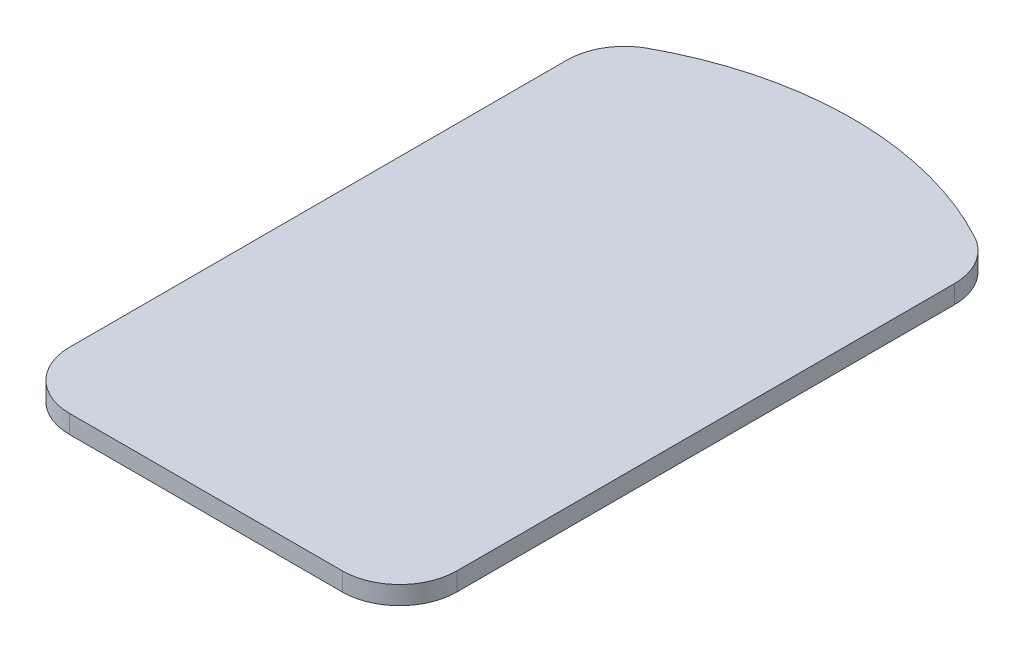
ISO-10303-21;
HEADER;
FILE_DESCRIPTION(('STEP AP214'),'2;1');
FILE_NAME('part.step','',(''),(''),'','','');
FILE_SCHEMA(('AUTOMOTIVE_DESIGN { 1 0 10303 214 1 1 1 1 }'));
ENDSEC;
DATA;
#1=APPLICATION_CONTEXT('core data for automotive mechanical design processes');
#2=APPLICATION_PROTOCOL_DEFINITION('international standard','automotive_design',2000,#1);
#3=PRODUCT_CONTEXT('',#1,'mechanical');
#4=PRODUCT('Part','Part','',(#3));
#5=PRODUCT_RELATED_PRODUCT_CATEGORY('part','',(#4));
#6=PRODUCT_DEFINITION_FORMATION('','',#4);
#7=PRODUCT_DEFINITION_CONTEXT('part definition',#1,'design');
#8=PRODUCT_DEFINITION('design','',#6,#7);
#9=PRODUCT_DEFINITION_SHAPE('','',#8);
#10=(LENGTH_UNIT() NAMED_UNIT(*) SI_UNIT(.MILLI.,.METRE.));
#11=(NAMED_UNIT(*) PLANE_ANGLE_UNIT() SI_UNIT($,.RADIAN.));
#12=(NAMED_UNIT(*) SI_UNIT($,.STERADIAN.) SOLID_ANGLE_UNIT());
#13=UNCERTAINTY_MEASURE_WITH_UNIT(LENGTH_MEASURE(1.E-05),#10,'distance_accuracy_value','');
#14=(GEOMETRIC_REPRESENTATION_CONTEXT(3) GLOBAL_UNCERTAINTY_ASSIGNED_CONTEXT((#13)) GLOBAL_UNIT_ASSIGNED_CONTEXT((#10,
#11,#12)) REPRESENTATION_CONTEXT('',''));
#15=CARTESIAN_POINT('',(0.,0.,0.));
#16=DIRECTION('',(0.,0.,1.));
#17=DIRECTION('',(1.,0.,0.));
#18=AXIS2_PLACEMENT_3D('',#15,#16,#17);
#19=CARTESIAN_POINT('',(-100.196877436676,1.6,22.5043252193321));
#20=DIRECTION('',(0.,-1.,0.));
#21=DIRECTION('',(0.,0.,-1.));
#22=AXIS2_PLACEMENT_3D('',#19,#20,#21);
#23=CYLINDRICAL_SURFACE('',#22,29.8500000000065);
#24=CARTESIAN_POINT('',(-100.196877436676,0.,22.5043252193321));
#25=DIRECTION('',(0.,1.,0.));
#26=DIRECTION('',(0.,0.,-1.));
#27=AXIS2_PLACEMENT_3D('',#24,#25,#26);
#28=CIRCLE('',#27,29.8500000000065);
#29=CARTESIAN_POINT('',(-85.91332210469,0.,-3.70640821333774));
#30=VERTEX_POINT('',#29);
#31=CARTESIAN_POINT('',(-114.480432768673,0.,-3.70640821333214));
#32=VERTEX_POINT('',#31);
#33=EDGE_CURVE('E127',#30,#32,#28,.T.);
#34=ORIENTED_EDGE('',*,*,#33,.T.);
#35=DIRECTION('',(0.,-1.,0.));
#36=VECTOR('',#35,1.);
#37=CARTESIAN_POINT('',(-114.480432768673,1.6,-3.70640821333214));
#38=LINE('',#37,#36);
#39=CARTESIAN_POINT('',(-114.480432768673,1.6,-3.70640821333214));
#40=VERTEX_POINT('',#39);
#41=EDGE_CURVE('E104',#32,#40,#38,.F.);
#42=ORIENTED_EDGE('',*,*,#41,.T.);
#43=CARTESIAN_POINT('',(-100.196877436676,1.6,22.5043252193321));
#44=DIRECTION('',(0.,1.,0.));
#45=DIRECTION('',(0.,0.,-1.));
#46=AXIS2_PLACEMENT_3D('',#43,#44,#45);
#47=CIRCLE('',#46,29.8500000000065);
#48=CARTESIAN_POINT('',(-85.91332210469,1.6,-3.70640821333774));
#49=VERTEX_POINT('',#48);
#50=EDGE_CURVE('E136',#49,#40,#47,.T.);
#51=ORIENTED_EDGE('',*,*,#50,.F.);
#52=DIRECTION('',(0.,-1.,0.));
#53=VECTOR('',#52,1.);
#54=CARTESIAN_POINT('',(-85.91332210469,1.6,-3.70640821333774));
#55=LINE('',#54,#53);
#56=EDGE_CURVE('E109',#49,#30,#55,.T.);
#57=ORIENTED_EDGE('',*,*,#56,.T.);
#58=EDGE_LOOP('',(#34,#42,#51,#57));
#59=FACE_BOUND('',#58,.T.);
#60=ADVANCED_FACE('F32',(#59),#23,.T.);
#61=CARTESIAN_POINT('',(-117.08787743668,1.6,49.0671381404292));
#62=DIRECTION('',(1.,0.,0.));
#63=DIRECTION('',(0.,0.,-1.));
#64=AXIS2_PLACEMENT_3D('',#61,#62,#63);
#65=PLANE('',#64);
#66=DIRECTION('',(0.,0.,1.));
#67=VECTOR('',#66,1.);
#68=CARTESIAN_POINT('',(-117.08787743668,1.6,49.0671381404292));
#69=LINE('',#68,#67);
#70=CARTESIAN_POINT('',(-117.08787743668,1.6,0.683999396828415));
#71=VERTEX_POINT('',#70);
#72=CARTESIAN_POINT('',(-117.08787743668,1.6,44.0671381404292));
#73=VERTEX_POINT('',#72);
#74=EDGE_CURVE('E119',#71,#73,#69,.T.);
#75=ORIENTED_EDGE('',*,*,#74,.F.);
#76=DIRECTION('',(0.,-1.,0.));
#77=VECTOR('',#76,1.);
#78=CARTESIAN_POINT('',(-117.08787743668,1.6,0.683999396828415));
#79=LINE('',#78,#77);
#80=CARTESIAN_POINT('',(-117.08787743668,0.,0.683999396828415));
#81=VERTEX_POINT('',#80);
#82=EDGE_CURVE('E103',#71,#81,#79,.T.);
#83=ORIENTED_EDGE('',*,*,#82,.T.);
#84=DIRECTION('',(0.,0.,1.));
#85=VECTOR('',#84,1.);
#86=CARTESIAN_POINT('',(-117.08787743668,0.,49.0671381404292));
#87=LINE('',#86,#85);
#88=CARTESIAN_POINT('',(-117.08787743668,0.,44.0671381404292));
#89=VERTEX_POINT('',#88);
#90=EDGE_CURVE('E116',#81,#89,#87,.T.);
#91=ORIENTED_EDGE('',*,*,#90,.T.);
#92=DIRECTION('',(0.,-1.,0.));
#93=VECTOR('',#92,1.);
#94=CARTESIAN_POINT('',(-117.08787743668,1.6,44.0671381404292));
#95=LINE('',#94,#93);
#96=EDGE_CURVE('E121',#89,#73,#95,.F.);
#97=ORIENTED_EDGE('',*,*,#96,.T.);
#98=EDGE_LOOP('',(#75,#83,#91,#97));
#99=FACE_BOUND('',#98,.T.);
#100=ADVANCED_FACE('F115',(#99),#65,.F.);
#101=CARTESIAN_POINT('',(-117.08787743668,1.6,49.0671381404292));
#102=DIRECTION('',(0.,0.,-1.));
#103=DIRECTION('',(-1.,0.,0.));
#104=AXIS2_PLACEMENT_3D('',#101,#102,#103);
#105=PLANE('',#104);
#106=DIRECTION('',(1.,0.,0.));
#107=VECTOR('',#106,1.);
#108=CARTESIAN_POINT('',(-117.08787743668,1.6,49.0671381404292));
#109=LINE('',#108,#107);
#110=CARTESIAN_POINT('',(-112.08787743668,1.6,49.0671381404292));
#111=VERTEX_POINT('',#110);
#112=CARTESIAN_POINT('',(-88.3058774366805,1.6,49.0671381404292));
#113=VERTEX_POINT('',#112);
#114=EDGE_CURVE('E159',#111,#113,#109,.T.);
#115=ORIENTED_EDGE('',*,*,#114,.F.);
#116=DIRECTION('',(0.,-1.,0.));
#117=VECTOR('',#116,1.);
#118=CARTESIAN_POINT('',(-112.08787743668,1.6,49.0671381404292));
#119=LINE('',#118,#117);
#120=CARTESIAN_POINT('',(-112.08787743668,0.,49.0671381404292));
#121=VERTEX_POINT('',#120);
#122=EDGE_CURVE('E11',#111,#121,#119,.T.);
#123=ORIENTED_EDGE('',*,*,#122,.T.);
#124=DIRECTION('',(1.,0.,0.));
#125=VECTOR('',#124,1.);
#126=CARTESIAN_POINT('',(-117.08787743668,0.,49.0671381404292));
#127=LINE('',#126,#125);
#128=CARTESIAN_POINT('',(-88.3058774366805,0.,49.0671381404292));
#129=VERTEX_POINT('',#128);
#130=EDGE_CURVE('E126',#121,#129,#127,.T.);
#131=ORIENTED_EDGE('',*,*,#130,.T.);
#132=DIRECTION('',(0.,-1.,0.));
#133=VECTOR('',#132,1.);
#134=CARTESIAN_POINT('',(-88.3058774366805,1.6,49.0671381404292));
#135=LINE('',#134,#133);
#136=EDGE_CURVE('E40',#129,#113,#135,.F.);
#137=ORIENTED_EDGE('',*,*,#136,.T.);
#138=EDGE_LOOP('',(#115,#123,#131,#137));
#139=FACE_BOUND('',#138,.T.);
#140=ADVANCED_FACE('F158',(#139),#105,.F.);
#141=CARTESIAN_POINT('',(-83.3058774366805,1.6,49.0671381404292));
#142=DIRECTION('',(-1.,0.,0.));
#143=DIRECTION('',(0.,0.,1.));
#144=AXIS2_PLACEMENT_3D('',#141,#142,#143);
#145=PLANE('',#144);
#146=DIRECTION('',(0.,0.,-1.));
#147=VECTOR('',#146,1.);
#148=CARTESIAN_POINT('',(-83.3058774366805,0.,49.0671381404292));
#149=LINE('',#148,#147);
#150=CARTESIAN_POINT('',(-83.3058774366805,0.,44.0671381404292));
#151=VERTEX_POINT('',#150);
#152=CARTESIAN_POINT('',(-83.3058774366805,0.,0.683999396823773));
#153=VERTEX_POINT('',#152);
#154=EDGE_CURVE('E130',#151,#153,#149,.T.);
#155=ORIENTED_EDGE('',*,*,#154,.T.);
#156=DIRECTION('',(0.,-1.,0.));
#157=VECTOR('',#156,1.);
#158=CARTESIAN_POINT('',(-83.3058774366805,1.6,0.683999396823759));
#159=LINE('',#158,#157);
#160=CARTESIAN_POINT('',(-83.3058774366805,1.6,0.683999396823773));
#161=VERTEX_POINT('',#160);
#162=EDGE_CURVE('E47',#153,#161,#159,.F.);
#163=ORIENTED_EDGE('',*,*,#162,.T.);
#164=DIRECTION('',(0.,0.,-1.));
#165=VECTOR('',#164,1.);
#166=CARTESIAN_POINT('',(-83.3058774366805,1.6,49.0671381404292));
#167=LINE('',#166,#165);
#168=CARTESIAN_POINT('',(-83.3058774366805,1.6,44.0671381404292));
#169=VERTEX_POINT('',#168);
#170=EDGE_CURVE('E137',#169,#161,#167,.T.);
#171=ORIENTED_EDGE('',*,*,#170,.F.);
#172=DIRECTION('',(0.,-1.,0.));
#173=VECTOR('',#172,1.);
#174=CARTESIAN_POINT('',(-83.3058774366805,1.6,44.0671381404292));
#175=LINE('',#174,#173);
#176=EDGE_CURVE('E152',#169,#151,#175,.T.);
#177=ORIENTED_EDGE('',*,*,#176,.T.);
#178=EDGE_LOOP('',(#155,#163,#171,#177));
#179=FACE_BOUND('',#178,.T.);
#180=ADVANCED_FACE('F168',(#179),#145,.F.);
#181=CARTESIAN_POINT('',(-100.196877436676,1.6,22.5043252193321));
#182=DIRECTION('',(0.,-1.,0.));
#183=DIRECTION('',(0.,0.,-1.));
#184=AXIS2_PLACEMENT_3D('',#181,#182,#183);
#185=PLANE('',#184);
#186=ORIENTED_EDGE('',*,*,#50,.T.);
#187=CARTESIAN_POINT('',(-112.08787743668,1.6,0.683999396828418));
#188=DIRECTION('',(0.,-1.,0.));
#189=DIRECTION('',(0.,0.,-1.));
#190=AXIS2_PLACEMENT_3D('',#187,#188,#189);
#191=CIRCLE('',#190,5.);
#192=EDGE_CURVE('E150',#40,#71,#191,.F.);
#193=ORIENTED_EDGE('',*,*,#192,.T.);
#194=ORIENTED_EDGE('',*,*,#74,.T.);
#195=CARTESIAN_POINT('',(-112.08787743668,1.6,44.0671381404292));
#196=DIRECTION('',(0.,-1.,0.));
#197=DIRECTION('',(0.,0.,-1.));
#198=AXIS2_PLACEMENT_3D('',#195,#196,#197);
#199=CIRCLE('',#198,5.);
#200=EDGE_CURVE('E146',#73,#111,#199,.F.);
#201=ORIENTED_EDGE('',*,*,#200,.T.);
#202=ORIENTED_EDGE('',*,*,#114,.T.);
#203=CARTESIAN_POINT('',(-88.3058774366805,1.6,44.0671381404292));
#204=DIRECTION('',(0.,-1.,0.));
#205=DIRECTION('',(0.,0.,-1.));
#206=AXIS2_PLACEMENT_3D('',#203,#204,#205);
#207=CIRCLE('',#206,5.);
#208=EDGE_CURVE('E54',#113,#169,#207,.F.);
#209=ORIENTED_EDGE('',*,*,#208,.T.);
#210=ORIENTED_EDGE('',*,*,#170,.T.);
#211=CARTESIAN_POINT('',(-88.3058774366805,1.6,0.683999396823762));
#212=DIRECTION('',(0.,-1.,0.));
#213=DIRECTION('',(0.,0.,-1.));
#214=AXIS2_PLACEMENT_3D('',#211,#212,#213);
#215=CIRCLE('',#214,5.);
#216=EDGE_CURVE('E148',#161,#49,#215,.F.);
#217=ORIENTED_EDGE('',*,*,#216,.T.);
#218=EDGE_LOOP('',(#186,#193,#194,#201,#202,#209,#210,#217));
#219=FACE_BOUND('',#218,.T.);
#220=ADVANCED_FACE('F163',(#219),#185,.F.);
#221=CARTESIAN_POINT('',(-100.196877436676,0.,22.5043252193321));
#222=DIRECTION('',(0.,-1.,0.));
#223=DIRECTION('',(0.,0.,-1.));
#224=AXIS2_PLACEMENT_3D('',#221,#222,#223);
#225=PLANE('',#224);
#226=ORIENTED_EDGE('',*,*,#90,.F.);
#227=CARTESIAN_POINT('',(-112.08787743668,0.,0.683999396828418));
#228=DIRECTION('',(0.,-1.,0.));
#229=DIRECTION('',(0.,0.,-1.));
#230=AXIS2_PLACEMENT_3D('',#227,#228,#229);
#231=CIRCLE('',#230,5.);
#232=EDGE_CURVE('E99',#81,#32,#231,.T.);
#233=ORIENTED_EDGE('',*,*,#232,.T.);
#234=ORIENTED_EDGE('',*,*,#33,.F.);
#235=CARTESIAN_POINT('',(-88.3058774366805,0.,0.683999396823762));
#236=DIRECTION('',(0.,-1.,0.));
#237=DIRECTION('',(0.,0.,-1.));
#238=AXIS2_PLACEMENT_3D('',#235,#236,#237);
#239=CIRCLE('',#238,5.);
#240=EDGE_CURVE('E110',#30,#153,#239,.T.);
#241=ORIENTED_EDGE('',*,*,#240,.T.);
#242=ORIENTED_EDGE('',*,*,#154,.F.);
#243=CARTESIAN_POINT('',(-88.3058774366805,0.,44.0671381404292));
#244=DIRECTION('',(0.,-1.,0.));
#245=DIRECTION('',(0.,0.,-1.));
#246=AXIS2_PLACEMENT_3D('',#243,#244,#245);
#247=CIRCLE('',#246,5.);
#248=EDGE_CURVE('E120',#151,#129,#247,.T.);
#249=ORIENTED_EDGE('',*,*,#248,.T.);
#250=ORIENTED_EDGE('',*,*,#130,.F.);
#251=CARTESIAN_POINT('',(-112.08787743668,0.,44.0671381404292));
#252=DIRECTION('',(0.,-1.,0.));
#253=DIRECTION('',(0.,0.,-1.));
#254=AXIS2_PLACEMENT_3D('',#251,#252,#253);
#255=CIRCLE('',#254,5.);
#256=EDGE_CURVE('E125',#121,#89,#255,.T.);
#257=ORIENTED_EDGE('',*,*,#256,.T.);
#258=EDGE_LOOP('',(#226,#233,#234,#241,#242,#249,#250,#257));
#259=FACE_BOUND('',#258,.T.);
#260=ADVANCED_FACE('F123',(#259),#225,.T.);
#261=CARTESIAN_POINT('',(-112.08787743668,1.6,0.683999396828418));
#262=DIRECTION('',(0.,-1.,0.));
#263=DIRECTION('',(0.,0.,-1.));
#264=AXIS2_PLACEMENT_3D('',#261,#262,#263);
#265=CYLINDRICAL_SURFACE('',#264,5.);
#266=ORIENTED_EDGE('',*,*,#192,.F.);
#267=ORIENTED_EDGE('',*,*,#41,.F.);
#268=ORIENTED_EDGE('',*,*,#232,.F.);
#269=ORIENTED_EDGE('',*,*,#82,.F.);
#270=EDGE_LOOP('',(#266,#267,#268,#269));
#271=FACE_BOUND('',#270,.T.);
#272=ADVANCED_FACE('F102',(#271),#265,.T.);
#273=CARTESIAN_POINT('',(-88.3058774366805,1.6,0.683999396823762));
#274=DIRECTION('',(0.,-1.,0.));
#275=DIRECTION('',(0.,0.,-1.));
#276=AXIS2_PLACEMENT_3D('',#273,#274,#275);
#277=CYLINDRICAL_SURFACE('',#276,5.);
#278=ORIENTED_EDGE('',*,*,#216,.F.);
#279=ORIENTED_EDGE('',*,*,#162,.F.);
#280=ORIENTED_EDGE('',*,*,#240,.F.);
#281=ORIENTED_EDGE('',*,*,#56,.F.);
#282=EDGE_LOOP('',(#278,#279,#280,#281));
#283=FACE_BOUND('',#282,.T.);
#284=ADVANCED_FACE('F172',(#283),#277,.T.);
#285=CARTESIAN_POINT('',(-112.08787743668,1.6,44.0671381404292));
#286=DIRECTION('',(0.,-1.,0.));
#287=DIRECTION('',(0.,0.,-1.));
#288=AXIS2_PLACEMENT_3D('',#285,#286,#287);
#289=CYLINDRICAL_SURFACE('',#288,5.);
#290=ORIENTED_EDGE('',*,*,#200,.F.);
#291=ORIENTED_EDGE('',*,*,#96,.F.);
#292=ORIENTED_EDGE('',*,*,#256,.F.);
#293=ORIENTED_EDGE('',*,*,#122,.F.);
#294=EDGE_LOOP('',(#290,#291,#292,#293));
#295=FACE_BOUND('',#294,.T.);
#296=ADVANCED_FACE('F178',(#295),#289,.T.);
#297=CARTESIAN_POINT('',(-88.3058774366805,1.6,44.0671381404292));
#298=DIRECTION('',(0.,-1.,0.));
#299=DIRECTION('',(0.,0.,-1.));
#300=AXIS2_PLACEMENT_3D('',#297,#298,#299);
#301=CYLINDRICAL_SURFACE('',#300,5.);
#302=ORIENTED_EDGE('',*,*,#208,.F.);
#303=ORIENTED_EDGE('',*,*,#136,.F.);
#304=ORIENTED_EDGE('',*,*,#248,.F.);
#305=ORIENTED_EDGE('',*,*,#176,.F.);
#306=EDGE_LOOP('',(#302,#303,#304,#305));
#307=FACE_BOUND('',#306,.T.);
#308=ADVANCED_FACE('F34',(#307),#301,.T.);
#309=CLOSED_SHELL('',(#60,#100,#140,#180,#220,#260,#272,#284,#296,#308));
#310=MANIFOLD_SOLID_BREP('B2',#309);
#311=ADVANCED_BREP_SHAPE_REPRESENTATION('',(#18,#310),#14);
#312=SHAPE_DEFINITION_REPRESENTATION(#9,#311);
ENDSEC;
END-ISO-10303-21;
